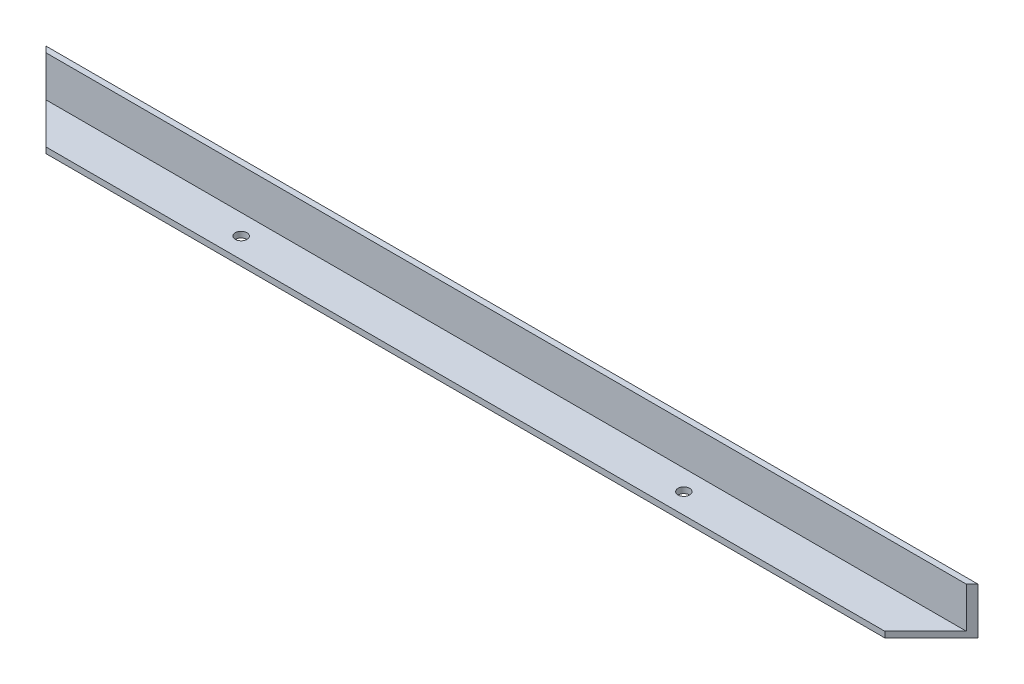
ISO-10303-21;
HEADER;
FILE_DESCRIPTION(('STEP AP214'),'2;1');
FILE_NAME('part.step','',(''),(''),'','','');
FILE_SCHEMA(('AUTOMOTIVE_DESIGN { 1 0 10303 214 1 1 1 1 }'));
ENDSEC;
DATA;
#1=APPLICATION_CONTEXT('core data for automotive mechanical design processes');
#2=APPLICATION_PROTOCOL_DEFINITION('international standard','automotive_design',2000,#1);
#3=PRODUCT_CONTEXT('',#1,'mechanical');
#4=PRODUCT('Part','Part','',(#3));
#5=PRODUCT_RELATED_PRODUCT_CATEGORY('part','',(#4));
#6=PRODUCT_DEFINITION_FORMATION('','',#4);
#7=PRODUCT_DEFINITION_CONTEXT('part definition',#1,'design');
#8=PRODUCT_DEFINITION('design','',#6,#7);
#9=PRODUCT_DEFINITION_SHAPE('','',#8);
#10=(LENGTH_UNIT() NAMED_UNIT(*) SI_UNIT(.MILLI.,.METRE.));
#11=(NAMED_UNIT(*) PLANE_ANGLE_UNIT() SI_UNIT($,.RADIAN.));
#12=(NAMED_UNIT(*) SI_UNIT($,.STERADIAN.) SOLID_ANGLE_UNIT());
#13=UNCERTAINTY_MEASURE_WITH_UNIT(LENGTH_MEASURE(1.E-05),#10,'distance_accuracy_value','');
#14=(GEOMETRIC_REPRESENTATION_CONTEXT(3) GLOBAL_UNCERTAINTY_ASSIGNED_CONTEXT((#13)) GLOBAL_UNIT_ASSIGNED_CONTEXT((#10,
#11,#12)) REPRESENTATION_CONTEXT('',''));
#15=CARTESIAN_POINT('',(0.,0.,0.));
#16=DIRECTION('',(0.,0.,1.));
#17=DIRECTION('',(1.,0.,0.));
#18=AXIS2_PLACEMENT_3D('',#15,#16,#17);
#19=CARTESIAN_POINT('',(0.,3.175,0.));
#20=DIRECTION('',(0.,-1.,0.));
#21=DIRECTION('',(0.,0.,-1.));
#22=AXIS2_PLACEMENT_3D('',#19,#20,#21);
#23=PLANE('',#22);
#24=CARTESIAN_POINT('',(-387.35,3.175,14.2875));
#25=DIRECTION('',(0.,1.,0.));
#26=DIRECTION('',(0.,0.,-1.));
#27=AXIS2_PLACEMENT_3D('',#24,#25,#26);
#28=CIRCLE('',#27,3.17499999999997);
#29=CARTESIAN_POINT('',(-387.35,3.175,11.1125));
#30=VERTEX_POINT('',#29);
#31=EDGE_CURVE('E142',#30,#30,#28,.T.);
#32=ORIENTED_EDGE('',*,*,#31,.F.);
#33=EDGE_LOOP('',(#32));
#34=FACE_BOUND('',#33,.T.);
#35=CARTESIAN_POINT('',(-146.05,3.175,14.2875));
#36=DIRECTION('',(0.,1.,0.));
#37=DIRECTION('',(0.,0.,1.));
#38=AXIS2_PLACEMENT_3D('',#35,#36,#37);
#39=CIRCLE('',#38,3.17499999999997);
#40=CARTESIAN_POINT('',(-146.05,3.175,17.4625));
#41=VERTEX_POINT('',#40);
#42=EDGE_CURVE('E153',#41,#41,#39,.T.);
#43=ORIENTED_EDGE('',*,*,#42,.F.);
#44=EDGE_LOOP('',(#43));
#45=FACE_BOUND('',#44,.T.);
#46=DIRECTION('',(1.,0.,0.));
#47=VECTOR('',#46,1.);
#48=CARTESIAN_POINT('',(-508.,3.175,3.175));
#49=LINE('',#48,#47);
#50=CARTESIAN_POINT('',(-504.825,3.175,3.175));
#51=VERTEX_POINT('',#50);
#52=CARTESIAN_POINT('',(-3.17500000000004,3.175,3.175));
#53=VERTEX_POINT('',#52);
#54=EDGE_CURVE('E104',#51,#53,#49,.T.);
#55=ORIENTED_EDGE('',*,*,#54,.F.);
#56=DIRECTION('',(0.707106781186551,0.,0.707106781186544));
#57=VECTOR('',#56,1.);
#58=CARTESIAN_POINT('',(-253.999999999997,3.175,254.));
#59=LINE('',#58,#57);
#60=CARTESIAN_POINT('',(-482.6,3.175,25.4));
#61=VERTEX_POINT('',#60);
#62=EDGE_CURVE('E140',#51,#61,#59,.T.);
#63=ORIENTED_EDGE('',*,*,#62,.T.);
#64=DIRECTION('',(1.,0.,0.));
#65=VECTOR('',#64,1.);
#66=CARTESIAN_POINT('',(0.,3.175,25.4));
#67=LINE('',#66,#65);
#68=CARTESIAN_POINT('',(-25.4000000000003,3.175,25.4));
#69=VERTEX_POINT('',#68);
#70=EDGE_CURVE('E96',#61,#69,#67,.T.);
#71=ORIENTED_EDGE('',*,*,#70,.T.);
#72=DIRECTION('',(0.707106781186551,0.,-0.707106781186544));
#73=VECTOR('',#72,1.);
#74=CARTESIAN_POINT('',(0.,3.175,0.));
#75=LINE('',#74,#73);
#76=EDGE_CURVE('E126',#69,#53,#75,.T.);
#77=ORIENTED_EDGE('',*,*,#76,.T.);
#78=EDGE_LOOP('',(#55,#63,#71,#77));
#79=FACE_BOUND('',#78,.T.);
#80=ADVANCED_FACE('F34',(#34,#45,#79),#23,.F.);
#81=CARTESIAN_POINT('',(0.,3.175,0.));
#82=DIRECTION('',(0.,0.,1.));
#83=DIRECTION('',(1.,0.,0.));
#84=AXIS2_PLACEMENT_3D('',#81,#82,#83);
#85=PLANE('',#84);
#86=DIRECTION('',(-1.,0.,0.));
#87=VECTOR('',#86,1.);
#88=CARTESIAN_POINT('',(0.,0.,0.));
#89=LINE('',#88,#87);
#90=CARTESIAN_POINT('',(0.,0.,0.));
#91=VERTEX_POINT('',#90);
#92=CARTESIAN_POINT('',(-508.,0.,0.));
#93=VERTEX_POINT('',#92);
#94=EDGE_CURVE('E95',#91,#93,#89,.T.);
#95=ORIENTED_EDGE('',*,*,#94,.T.);
#96=DIRECTION('',(0.,-1.,0.));
#97=VECTOR('',#96,1.);
#98=CARTESIAN_POINT('',(-508.,3.175,0.));
#99=LINE('',#98,#97);
#100=CARTESIAN_POINT('',(-508.,25.4,0.));
#101=VERTEX_POINT('',#100);
#102=EDGE_CURVE('E85',#101,#93,#99,.T.);
#103=ORIENTED_EDGE('',*,*,#102,.F.);
#104=DIRECTION('',(-1.,0.,0.));
#105=VECTOR('',#104,1.);
#106=CARTESIAN_POINT('',(-508.,25.4,0.));
#107=LINE('',#106,#105);
#108=CARTESIAN_POINT('',(0.,25.4,0.));
#109=VERTEX_POINT('',#108);
#110=EDGE_CURVE('E93',#109,#101,#107,.T.);
#111=ORIENTED_EDGE('',*,*,#110,.F.);
#112=DIRECTION('',(0.,-1.,0.));
#113=VECTOR('',#112,1.);
#114=CARTESIAN_POINT('',(0.,3.175,0.));
#115=LINE('',#114,#113);
#116=EDGE_CURVE('E42',#109,#91,#115,.T.);
#117=ORIENTED_EDGE('',*,*,#116,.T.);
#118=EDGE_LOOP('',(#95,#103,#111,#117));
#119=FACE_BOUND('',#118,.T.);
#120=ADVANCED_FACE('F36',(#119),#85,.F.);
#121=CARTESIAN_POINT('',(0.,3.175,25.4));
#122=DIRECTION('',(0.,0.,-1.));
#123=DIRECTION('',(-1.,0.,0.));
#124=AXIS2_PLACEMENT_3D('',#121,#122,#123);
#125=PLANE('',#124);
#126=ORIENTED_EDGE('',*,*,#70,.F.);
#127=DIRECTION('',(0.,-1.,0.));
#128=VECTOR('',#127,1.);
#129=CARTESIAN_POINT('',(-482.6,3.175,25.4));
#130=LINE('',#129,#128);
#131=CARTESIAN_POINT('',(-482.6,0.,25.4));
#132=VERTEX_POINT('',#131);
#133=EDGE_CURVE('E118',#61,#132,#130,.T.);
#134=ORIENTED_EDGE('',*,*,#133,.T.);
#135=DIRECTION('',(1.,0.,0.));
#136=VECTOR('',#135,1.);
#137=CARTESIAN_POINT('',(0.,0.,25.4));
#138=LINE('',#137,#136);
#139=CARTESIAN_POINT('',(-25.4000000000003,0.,25.4));
#140=VERTEX_POINT('',#139);
#141=EDGE_CURVE('E102',#132,#140,#138,.T.);
#142=ORIENTED_EDGE('',*,*,#141,.T.);
#143=DIRECTION('',(0.,1.,0.));
#144=VECTOR('',#143,1.);
#145=CARTESIAN_POINT('',(-25.4000000000003,3.175,25.4));
#146=LINE('',#145,#144);
#147=EDGE_CURVE('E109',#140,#69,#146,.T.);
#148=ORIENTED_EDGE('',*,*,#147,.T.);
#149=EDGE_LOOP('',(#126,#134,#142,#148));
#150=FACE_BOUND('',#149,.T.);
#151=ADVANCED_FACE('F117',(#150),#125,.F.);
#152=CARTESIAN_POINT('',(0.,0.,0.));
#153=DIRECTION('',(0.,-1.,0.));
#154=DIRECTION('',(0.,0.,-1.));
#155=AXIS2_PLACEMENT_3D('',#152,#153,#154);
#156=PLANE('',#155);
#157=DIRECTION('',(-0.707106781186551,0.,-0.707106781186544));
#158=VECTOR('',#157,1.);
#159=CARTESIAN_POINT('',(-508.,0.,0.));
#160=LINE('',#159,#158);
#161=EDGE_CURVE('E144',#132,#93,#160,.T.);
#162=ORIENTED_EDGE('',*,*,#161,.T.);
#163=ORIENTED_EDGE('',*,*,#94,.F.);
#164=DIRECTION('',(-0.707106781186551,0.,0.707106781186544));
#165=VECTOR('',#164,1.);
#166=CARTESIAN_POINT('',(0.,0.,0.));
#167=LINE('',#166,#165);
#168=EDGE_CURVE('E123',#91,#140,#167,.T.);
#169=ORIENTED_EDGE('',*,*,#168,.T.);
#170=ORIENTED_EDGE('',*,*,#141,.F.);
#171=EDGE_LOOP('',(#162,#163,#169,#170));
#172=FACE_BOUND('',#171,.T.);
#173=CARTESIAN_POINT('',(-387.35,0.,14.2875));
#174=DIRECTION('',(0.,-1.,0.));
#175=DIRECTION('',(0.,0.,-1.));
#176=AXIS2_PLACEMENT_3D('',#173,#174,#175);
#177=CIRCLE('',#176,3.17499999999997);
#178=CARTESIAN_POINT('',(-387.35,0.,11.1125));
#179=VERTEX_POINT('',#178);
#180=EDGE_CURVE('E150',#179,#179,#177,.F.);
#181=ORIENTED_EDGE('',*,*,#180,.T.);
#182=EDGE_LOOP('',(#181));
#183=FACE_BOUND('',#182,.T.);
#184=CARTESIAN_POINT('',(-146.05,0.,14.2875));
#185=DIRECTION('',(0.,-1.,0.));
#186=DIRECTION('',(0.,0.,-1.));
#187=AXIS2_PLACEMENT_3D('',#184,#185,#186);
#188=CIRCLE('',#187,3.17499999999997);
#189=CARTESIAN_POINT('',(-146.05,0.,11.1125));
#190=VERTEX_POINT('',#189);
#191=EDGE_CURVE('E133',#190,#190,#188,.F.);
#192=ORIENTED_EDGE('',*,*,#191,.T.);
#193=EDGE_LOOP('',(#192));
#194=FACE_BOUND('',#193,.T.);
#195=ADVANCED_FACE('F127',(#172,#183,#194),#156,.T.);
#196=CARTESIAN_POINT('',(-508.,25.4,3.175));
#197=DIRECTION('',(0.,0.,-1.));
#198=DIRECTION('',(-1.,0.,0.));
#199=AXIS2_PLACEMENT_3D('',#196,#197,#198);
#200=PLANE('',#199);
#201=DIRECTION('',(1.,0.,0.));
#202=VECTOR('',#201,1.);
#203=CARTESIAN_POINT('',(-508.,25.4,3.175));
#204=LINE('',#203,#202);
#205=CARTESIAN_POINT('',(-504.825,25.4,3.17499999999994));
#206=VERTEX_POINT('',#205);
#207=CARTESIAN_POINT('',(-3.17500000000004,25.4,3.175));
#208=VERTEX_POINT('',#207);
#209=EDGE_CURVE('E100',#206,#208,#204,.T.);
#210=ORIENTED_EDGE('',*,*,#209,.F.);
#211=DIRECTION('',(0.,-1.,0.));
#212=VECTOR('',#211,1.);
#213=CARTESIAN_POINT('',(-504.825,25.4,3.175));
#214=LINE('',#213,#212);
#215=EDGE_CURVE('E48',#206,#51,#214,.T.);
#216=ORIENTED_EDGE('',*,*,#215,.T.);
#217=ORIENTED_EDGE('',*,*,#54,.T.);
#218=DIRECTION('',(0.,1.,0.));
#219=VECTOR('',#218,1.);
#220=CARTESIAN_POINT('',(-3.17500000000004,25.4,3.175));
#221=LINE('',#220,#219);
#222=EDGE_CURVE('E129',#53,#208,#221,.T.);
#223=ORIENTED_EDGE('',*,*,#222,.T.);
#224=EDGE_LOOP('',(#210,#216,#217,#223));
#225=FACE_BOUND('',#224,.T.);
#226=ADVANCED_FACE('F181',(#225),#200,.F.);
#227=CARTESIAN_POINT('',(0.,25.4,0.));
#228=DIRECTION('',(0.,1.,0.));
#229=DIRECTION('',(0.,0.,1.));
#230=AXIS2_PLACEMENT_3D('',#227,#228,#229);
#231=PLANE('',#230);
#232=DIRECTION('',(-0.707106781186551,0.,-0.707106781186544));
#233=VECTOR('',#232,1.);
#234=CARTESIAN_POINT('',(-253.999999999997,25.4,254.));
#235=LINE('',#234,#233);
#236=EDGE_CURVE('E11',#206,#101,#235,.T.);
#237=ORIENTED_EDGE('',*,*,#236,.F.);
#238=ORIENTED_EDGE('',*,*,#209,.T.);
#239=DIRECTION('',(-0.707106781186551,0.,0.707106781186544));
#240=VECTOR('',#239,1.);
#241=CARTESIAN_POINT('',(0.,25.4,0.));
#242=LINE('',#241,#240);
#243=EDGE_CURVE('E99',#109,#208,#242,.T.);
#244=ORIENTED_EDGE('',*,*,#243,.F.);
#245=ORIENTED_EDGE('',*,*,#110,.T.);
#246=EDGE_LOOP('',(#237,#238,#244,#245));
#247=FACE_BOUND('',#246,.T.);
#248=ADVANCED_FACE('F98',(#247),#231,.T.);
#249=CARTESIAN_POINT('',(0.,-114.523507228448,0.));
#250=DIRECTION('',(-0.707106781186544,0.,-0.707106781186551));
#251=DIRECTION('',(-0.707106781186551,0.,0.707106781186544));
#252=AXIS2_PLACEMENT_3D('',#249,#250,#251);
#253=PLANE('',#252);
#254=ORIENTED_EDGE('',*,*,#168,.F.);
#255=ORIENTED_EDGE('',*,*,#116,.F.);
#256=ORIENTED_EDGE('',*,*,#243,.T.);
#257=ORIENTED_EDGE('',*,*,#222,.F.);
#258=ORIENTED_EDGE('',*,*,#76,.F.);
#259=ORIENTED_EDGE('',*,*,#147,.F.);
#260=EDGE_LOOP('',(#254,#255,#256,#257,#258,#259));
#261=FACE_BOUND('',#260,.T.);
#262=ADVANCED_FACE('F122',(#261),#253,.F.);
#263=CARTESIAN_POINT('',(-146.05,-8.98025612106909,14.2875));
#264=DIRECTION('',(0.,1.,0.));
#265=DIRECTION('',(0.,0.,1.));
#266=AXIS2_PLACEMENT_3D('',#263,#264,#265);
#267=CYLINDRICAL_SURFACE('',#266,3.17499999999997);
#268=ORIENTED_EDGE('',*,*,#42,.T.);
#269=EDGE_LOOP('',(#268));
#270=FACE_BOUND('',#269,.T.);
#271=ORIENTED_EDGE('',*,*,#191,.F.);
#272=EDGE_LOOP('',(#271));
#273=FACE_BOUND('',#272,.T.);
#274=ADVANCED_FACE('F159',(#270,#273),#267,.F.);
#275=CARTESIAN_POINT('',(-387.35,-8.98025612106909,14.2875));
#276=DIRECTION('',(0.,1.,0.));
#277=DIRECTION('',(0.,0.,1.));
#278=AXIS2_PLACEMENT_3D('',#275,#276,#277);
#279=CYLINDRICAL_SURFACE('',#278,3.17499999999997);
#280=ORIENTED_EDGE('',*,*,#31,.T.);
#281=EDGE_LOOP('',(#280));
#282=FACE_BOUND('',#281,.T.);
#283=ORIENTED_EDGE('',*,*,#180,.F.);
#284=EDGE_LOOP('',(#283));
#285=FACE_BOUND('',#284,.T.);
#286=ADVANCED_FACE('F161',(#282,#285),#279,.F.);
#287=CARTESIAN_POINT('',(-508.,-77.6678417992236,0.));
#288=DIRECTION('',(0.707106781186544,0.,-0.707106781186551));
#289=DIRECTION('',(-0.707106781186551,0.,-0.707106781186544));
#290=AXIS2_PLACEMENT_3D('',#287,#288,#289);
#291=PLANE('',#290);
#292=ORIENTED_EDGE('',*,*,#62,.F.);
#293=ORIENTED_EDGE('',*,*,#215,.F.);
#294=ORIENTED_EDGE('',*,*,#236,.T.);
#295=ORIENTED_EDGE('',*,*,#102,.T.);
#296=ORIENTED_EDGE('',*,*,#161,.F.);
#297=ORIENTED_EDGE('',*,*,#133,.F.);
#298=EDGE_LOOP('',(#292,#293,#294,#295,#296,#297));
#299=FACE_BOUND('',#298,.T.);
#300=ADVANCED_FACE('F84',(#299),#291,.F.);
#301=CLOSED_SHELL('',(#80,#120,#151,#195,#226,#248,#262,#274,#286,#300));
#302=MANIFOLD_SOLID_BREP('B2',#301);
#303=ADVANCED_BREP_SHAPE_REPRESENTATION('',(#18,#302),#14);
#304=SHAPE_DEFINITION_REPRESENTATION(#9,#303);
ENDSEC;
END-ISO-10303-21;
